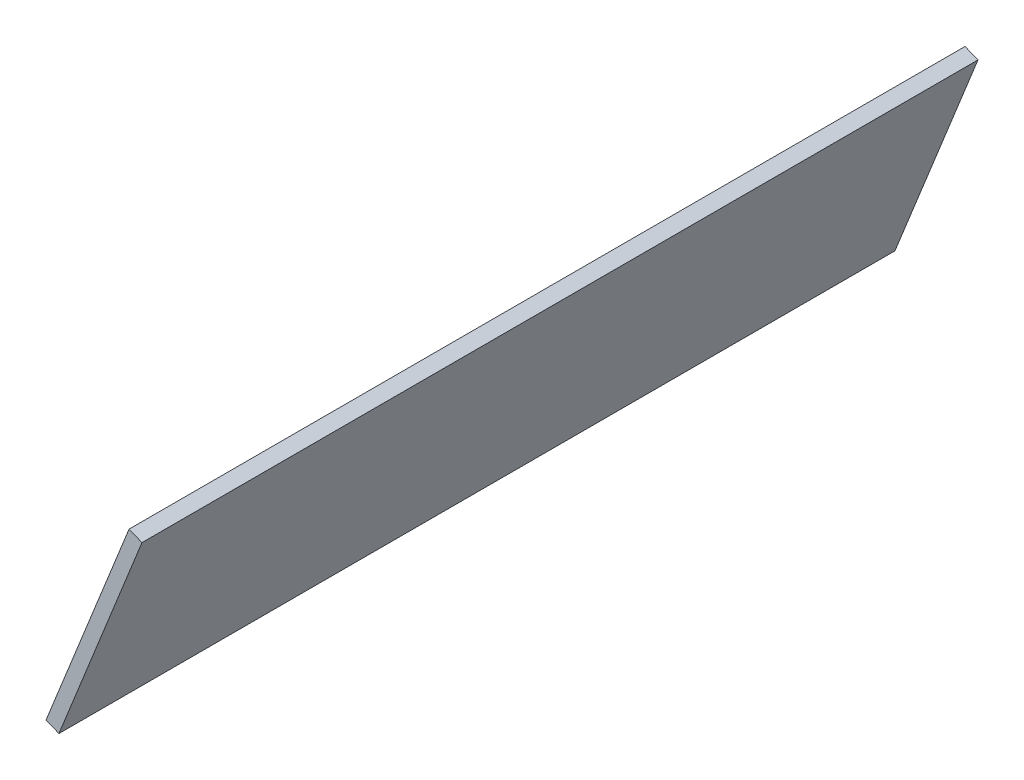
ISO-10303-21;
HEADER;
FILE_DESCRIPTION(('STEP AP214'),'2;1');
FILE_NAME('part.step','',(''),(''),'','','');
FILE_SCHEMA(('AUTOMOTIVE_DESIGN { 1 0 10303 214 1 1 1 1 }'));
ENDSEC;
DATA;
#1=APPLICATION_CONTEXT('core data for automotive mechanical design processes');
#2=APPLICATION_PROTOCOL_DEFINITION('international standard','automotive_design',2000,#1);
#3=PRODUCT_CONTEXT('',#1,'mechanical');
#4=PRODUCT('Part','Part','',(#3));
#5=PRODUCT_RELATED_PRODUCT_CATEGORY('part','',(#4));
#6=PRODUCT_DEFINITION_FORMATION('','',#4);
#7=PRODUCT_DEFINITION_CONTEXT('part definition',#1,'design');
#8=PRODUCT_DEFINITION('design','',#6,#7);
#9=PRODUCT_DEFINITION_SHAPE('','',#8);
#10=(LENGTH_UNIT() NAMED_UNIT(*) SI_UNIT(.MILLI.,.METRE.));
#11=(NAMED_UNIT(*) PLANE_ANGLE_UNIT() SI_UNIT($,.RADIAN.));
#12=(NAMED_UNIT(*) SI_UNIT($,.STERADIAN.) SOLID_ANGLE_UNIT());
#13=UNCERTAINTY_MEASURE_WITH_UNIT(LENGTH_MEASURE(1.E-05),#10,'distance_accuracy_value','');
#14=(GEOMETRIC_REPRESENTATION_CONTEXT(3) GLOBAL_UNCERTAINTY_ASSIGNED_CONTEXT((#13)) GLOBAL_UNIT_ASSIGNED_CONTEXT((#10,
#11,#12)) REPRESENTATION_CONTEXT('',''));
#15=CARTESIAN_POINT('',(0.,0.,0.));
#16=DIRECTION('',(0.,0.,1.));
#17=DIRECTION('',(1.,0.,0.));
#18=AXIS2_PLACEMENT_3D('',#15,#16,#17);
#19=CARTESIAN_POINT('',(-61.8039827109403,373.954096471465,600.));
#20=DIRECTION('',(-0.372527470166856,-0.928021165691323,0.));
#21=DIRECTION('',(0.928021165691323,-0.372527470166856,0.));
#22=AXIS2_PLACEMENT_3D('',#19,#20,#21);
#23=PLANE('',#22);
#24=DIRECTION('',(-0.928021165691323,0.372527470166856,0.));
#25=VECTOR('',#24,1.);
#26=CARTESIAN_POINT('',(-61.8039827109403,373.954096471465,0.));
#27=LINE('',#26,#25);
#28=CARTESIAN_POINT('',(-61.8039827109403,373.954096471465,0.));
#29=VERTEX_POINT('',#28);
#30=CARTESIAN_POINT('',(-71.0841943678536,377.679371173133,0.));
#31=VERTEX_POINT('',#30);
#32=EDGE_CURVE('E96',#29,#31,#27,.T.);
#33=ORIENTED_EDGE('',*,*,#32,.T.);
#34=DIRECTION('',(0.,0.,-1.));
#35=VECTOR('',#34,1.);
#36=CARTESIAN_POINT('',(-71.0841943678536,377.679371173133,600.));
#37=LINE('',#36,#35);
#38=CARTESIAN_POINT('',(-71.0841943678536,377.679371173133,600.));
#39=VERTEX_POINT('',#38);
#40=EDGE_CURVE('E11',#39,#31,#37,.T.);
#41=ORIENTED_EDGE('',*,*,#40,.F.);
#42=DIRECTION('',(-0.928021165691323,0.372527470166856,0.));
#43=VECTOR('',#42,1.);
#44=CARTESIAN_POINT('',(-61.8039827109403,373.954096471465,600.));
#45=LINE('',#44,#43);
#46=CARTESIAN_POINT('',(-61.8039827109403,373.954096471465,600.));
#47=VERTEX_POINT('',#46);
#48=EDGE_CURVE('E84',#47,#39,#45,.T.);
#49=ORIENTED_EDGE('',*,*,#48,.F.);
#50=DIRECTION('',(0.,0.,-1.));
#51=VECTOR('',#50,1.);
#52=CARTESIAN_POINT('',(-61.8039827109403,373.954096471465,600.));
#53=LINE('',#52,#51);
#54=EDGE_CURVE('E92',#47,#29,#53,.T.);
#55=ORIENTED_EDGE('',*,*,#54,.T.);
#56=EDGE_LOOP('',(#33,#41,#49,#55));
#57=FACE_BOUND('',#56,.T.);
#58=ADVANCED_FACE('F33',(#57),#23,.F.);
#59=CARTESIAN_POINT('',(-71.0841943678536,377.679371173133,600.));
#60=DIRECTION('',(0.928021165691322,-0.372527470166858,0.));
#61=DIRECTION('',(0.372527470166858,0.928021165691322,0.));
#62=AXIS2_PLACEMENT_3D('',#59,#60,#61);
#63=PLANE('',#62);
#64=DIRECTION('',(-0.372527470166858,-0.928021165691322,0.));
#65=VECTOR('',#64,1.);
#66=CARTESIAN_POINT('',(-71.0841943678536,377.679371173133,0.));
#67=LINE('',#66,#65);
#68=CARTESIAN_POINT('',(-130.685869422992,229.202761013216,0.));
#69=VERTEX_POINT('',#68);
#70=EDGE_CURVE('E88',#31,#69,#67,.T.);
#71=ORIENTED_EDGE('',*,*,#70,.T.);
#72=DIRECTION('',(0.,0.,-1.));
#73=VECTOR('',#72,1.);
#74=CARTESIAN_POINT('',(-130.685869422992,229.202761013216,600.));
#75=LINE('',#74,#73);
#76=CARTESIAN_POINT('',(-130.685869422992,229.202761013216,600.));
#77=VERTEX_POINT('',#76);
#78=EDGE_CURVE('E41',#77,#69,#75,.T.);
#79=ORIENTED_EDGE('',*,*,#78,.F.);
#80=DIRECTION('',(-0.372527470166858,-0.928021165691322,0.));
#81=VECTOR('',#80,1.);
#82=CARTESIAN_POINT('',(-71.0841943678536,377.679371173133,600.));
#83=LINE('',#82,#81);
#84=EDGE_CURVE('E79',#39,#77,#83,.T.);
#85=ORIENTED_EDGE('',*,*,#84,.F.);
#86=ORIENTED_EDGE('',*,*,#40,.T.);
#87=EDGE_LOOP('',(#71,#79,#85,#86));
#88=FACE_BOUND('',#87,.T.);
#89=ADVANCED_FACE('F87',(#88),#63,.F.);
#90=CARTESIAN_POINT('',(-130.685869422992,229.202761013216,600.));
#91=DIRECTION('',(0.372527470166859,0.928021165691322,0.));
#92=DIRECTION('',(-0.928021165691322,0.372527470166859,0.));
#93=AXIS2_PLACEMENT_3D('',#90,#91,#92);
#94=PLANE('',#93);
#95=DIRECTION('',(0.928021165691322,-0.372527470166859,0.));
#96=VECTOR('',#95,1.);
#97=CARTESIAN_POINT('',(-130.685869422992,229.202761013216,0.));
#98=LINE('',#97,#96);
#99=CARTESIAN_POINT('',(-121.405657766079,225.477486311547,0.));
#100=VERTEX_POINT('',#99);
#101=EDGE_CURVE('E66',#69,#100,#98,.T.);
#102=ORIENTED_EDGE('',*,*,#101,.T.);
#103=DIRECTION('',(0.,0.,-1.));
#104=VECTOR('',#103,1.);
#105=CARTESIAN_POINT('',(-121.405657766079,225.477486311547,600.));
#106=LINE('',#105,#104);
#107=CARTESIAN_POINT('',(-121.405657766079,225.477486311547,600.));
#108=VERTEX_POINT('',#107);
#109=EDGE_CURVE('E89',#108,#100,#106,.T.);
#110=ORIENTED_EDGE('',*,*,#109,.F.);
#111=DIRECTION('',(0.928021165691322,-0.372527470166859,0.));
#112=VECTOR('',#111,1.);
#113=CARTESIAN_POINT('',(-130.685869422992,229.202761013216,600.));
#114=LINE('',#113,#112);
#115=EDGE_CURVE('E82',#77,#108,#114,.T.);
#116=ORIENTED_EDGE('',*,*,#115,.F.);
#117=ORIENTED_EDGE('',*,*,#78,.T.);
#118=EDGE_LOOP('',(#102,#110,#116,#117));
#119=FACE_BOUND('',#118,.T.);
#120=ADVANCED_FACE('F90',(#119),#94,.F.);
#121=CARTESIAN_POINT('',(-121.405657766079,225.477486311547,600.));
#122=DIRECTION('',(-0.928021165691322,0.372527470166858,0.));
#123=DIRECTION('',(-0.372527470166858,-0.928021165691322,0.));
#124=AXIS2_PLACEMENT_3D('',#121,#122,#123);
#125=PLANE('',#124);
#126=DIRECTION('',(0.372527470166858,0.928021165691322,0.));
#127=VECTOR('',#126,1.);
#128=CARTESIAN_POINT('',(-121.405657766079,225.477486311547,0.));
#129=LINE('',#128,#127);
#130=EDGE_CURVE('E72',#100,#29,#129,.T.);
#131=ORIENTED_EDGE('',*,*,#130,.T.);
#132=ORIENTED_EDGE('',*,*,#54,.F.);
#133=DIRECTION('',(0.372527470166858,0.928021165691322,0.));
#134=VECTOR('',#133,1.);
#135=CARTESIAN_POINT('',(-121.405657766079,225.477486311547,600.));
#136=LINE('',#135,#134);
#137=EDGE_CURVE('E49',#108,#47,#136,.T.);
#138=ORIENTED_EDGE('',*,*,#137,.F.);
#139=ORIENTED_EDGE('',*,*,#109,.T.);
#140=EDGE_LOOP('',(#131,#132,#138,#139));
#141=FACE_BOUND('',#140,.T.);
#142=ADVANCED_FACE('F103',(#141),#125,.F.);
#143=CARTESIAN_POINT('',(0.,0.,600.));
#144=DIRECTION('',(0.,0.,1.));
#145=DIRECTION('',(1.,0.,0.));
#146=AXIS2_PLACEMENT_3D('',#143,#144,#145);
#147=PLANE('',#146);
#148=ORIENTED_EDGE('',*,*,#48,.T.);
#149=ORIENTED_EDGE('',*,*,#84,.T.);
#150=ORIENTED_EDGE('',*,*,#115,.T.);
#151=ORIENTED_EDGE('',*,*,#137,.T.);
#152=EDGE_LOOP('',(#148,#149,#150,#151));
#153=FACE_BOUND('',#152,.T.);
#154=ADVANCED_FACE('F80',(#153),#147,.T.);
#155=CARTESIAN_POINT('',(0.,0.,0.));
#156=DIRECTION('',(0.,0.,1.));
#157=DIRECTION('',(1.,0.,0.));
#158=AXIS2_PLACEMENT_3D('',#155,#156,#157);
#159=PLANE('',#158);
#160=ORIENTED_EDGE('',*,*,#32,.F.);
#161=ORIENTED_EDGE('',*,*,#130,.F.);
#162=ORIENTED_EDGE('',*,*,#101,.F.);
#163=ORIENTED_EDGE('',*,*,#70,.F.);
#164=EDGE_LOOP('',(#160,#161,#162,#163));
#165=FACE_BOUND('',#164,.T.);
#166=ADVANCED_FACE('F106',(#165),#159,.F.);
#167=CLOSED_SHELL('',(#58,#89,#120,#142,#154,#166));
#168=MANIFOLD_SOLID_BREP('B2',#167);
#169=ADVANCED_BREP_SHAPE_REPRESENTATION('',(#18,#168),#14);
#170=SHAPE_DEFINITION_REPRESENTATION(#9,#169);
ENDSEC;
END-ISO-10303-21;
